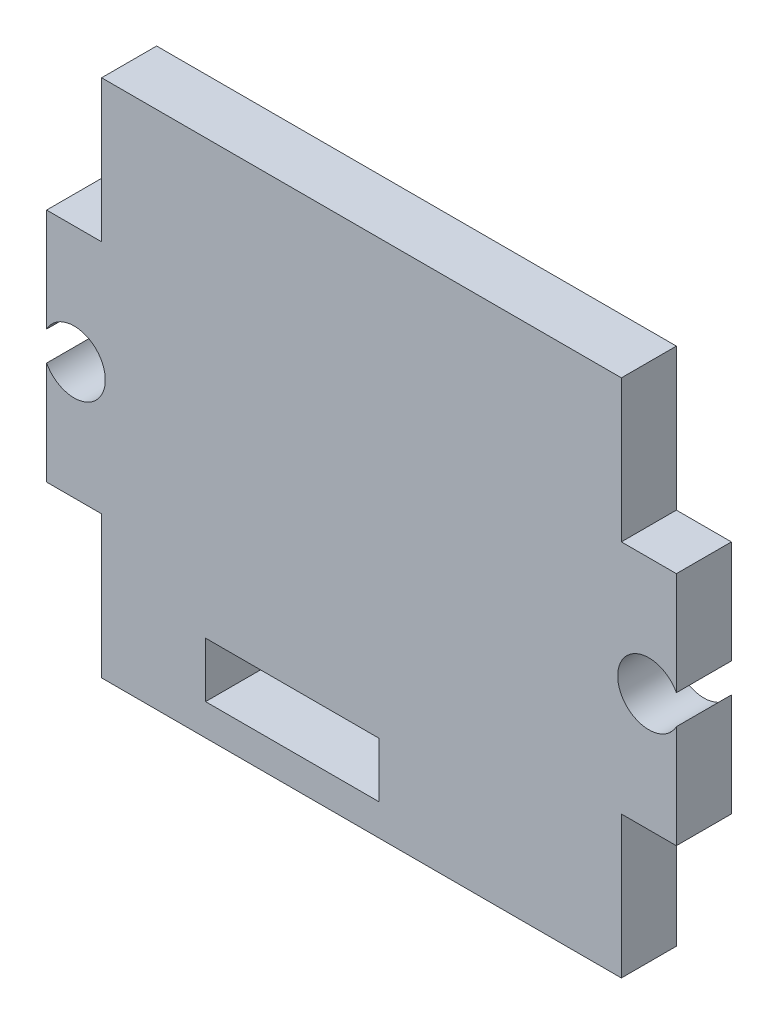
ISO-10303-21;
HEADER;
FILE_DESCRIPTION(('STEP AP214'),'2;1');
FILE_NAME('part.step','',(''),(''),'','','');
FILE_SCHEMA(('AUTOMOTIVE_DESIGN { 1 0 10303 214 1 1 1 1 }'));
ENDSEC;
DATA;
#1=APPLICATION_CONTEXT('core data for automotive mechanical design processes');
#2=APPLICATION_PROTOCOL_DEFINITION('international standard','automotive_design',2000,#1);
#3=PRODUCT_CONTEXT('',#1,'mechanical');
#4=PRODUCT('Part','Part','',(#3));
#5=PRODUCT_RELATED_PRODUCT_CATEGORY('part','',(#4));
#6=PRODUCT_DEFINITION_FORMATION('','',#4);
#7=PRODUCT_DEFINITION_CONTEXT('part definition',#1,'design');
#8=PRODUCT_DEFINITION('design','',#6,#7);
#9=PRODUCT_DEFINITION_SHAPE('','',#8);
#10=(LENGTH_UNIT() NAMED_UNIT(*) SI_UNIT(.MILLI.,.METRE.));
#11=(NAMED_UNIT(*) PLANE_ANGLE_UNIT() SI_UNIT($,.RADIAN.));
#12=(NAMED_UNIT(*) SI_UNIT($,.STERADIAN.) SOLID_ANGLE_UNIT());
#13=UNCERTAINTY_MEASURE_WITH_UNIT(LENGTH_MEASURE(1.E-05),#10,'distance_accuracy_value','');
#14=(GEOMETRIC_REPRESENTATION_CONTEXT(3) GLOBAL_UNCERTAINTY_ASSIGNED_CONTEXT((#13)) GLOBAL_UNIT_ASSIGNED_CONTEXT((#10,
#11,#12)) REPRESENTATION_CONTEXT('',''));
#15=CARTESIAN_POINT('',(0.,0.,0.));
#16=DIRECTION('',(0.,0.,1.));
#17=DIRECTION('',(1.,0.,0.));
#18=AXIS2_PLACEMENT_3D('',#15,#16,#17);
#19=CARTESIAN_POINT('',(-35.2680016104986,32.7807662428356,3.175));
#20=DIRECTION('',(0.,0.,1.));
#21=DIRECTION('',(1.,0.,0.));
#22=AXIS2_PLACEMENT_3D('',#19,#20,#21);
#23=PLANE('',#22);
#24=DIRECTION('',(0.,-1.,0.));
#25=VECTOR('',#24,1.);
#26=CARTESIAN_POINT('',(-33.6805016104986,47.7807662428356,3.175));
#27=LINE('',#26,#25);
#28=CARTESIAN_POINT('',(-33.6805016104986,47.7807662428356,3.175));
#29=VERTEX_POINT('',#28);
#30=CARTESIAN_POINT('',(-33.6805016104986,39.5807662428356,3.175));
#31=VERTEX_POINT('',#30);
#32=EDGE_CURVE('E206',#29,#31,#27,.T.);
#33=ORIENTED_EDGE('',*,*,#32,.T.);
#34=DIRECTION('',(-1.,0.,0.));
#35=VECTOR('',#34,1.);
#36=CARTESIAN_POINT('',(-33.6805016104986,39.5807662428356,3.175));
#37=LINE('',#36,#35);
#38=CARTESIAN_POINT('',(-36.8555016104986,39.5807662428356,3.175));
#39=VERTEX_POINT('',#38);
#40=EDGE_CURVE('E209',#31,#39,#37,.T.);
#41=ORIENTED_EDGE('',*,*,#40,.T.);
#42=DIRECTION('',(0.,-1.,0.));
#43=VECTOR('',#42,1.);
#44=CARTESIAN_POINT('',(-36.8555016104986,39.5807662428356,3.175));
#45=LINE('',#44,#43);
#46=CARTESIAN_POINT('',(-36.8555016104986,33.6292023040683,3.175));
#47=VERTEX_POINT('',#46);
#48=EDGE_CURVE('E212',#39,#47,#45,.T.);
#49=ORIENTED_EDGE('',*,*,#48,.T.);
#50=CARTESIAN_POINT('',(-35.2680016104986,32.7807662428356,3.175));
#51=DIRECTION('',(0.,0.,-1.));
#52=DIRECTION('',(1.,0.,0.));
#53=AXIS2_PLACEMENT_3D('',#50,#51,#52);
#54=CIRCLE('',#53,1.8);
#55=CARTESIAN_POINT('',(-36.8555016104986,31.9323301816029,3.175));
#56=VERTEX_POINT('',#55);
#57=EDGE_CURVE('E214',#47,#56,#54,.T.);
#58=ORIENTED_EDGE('',*,*,#57,.T.);
#59=DIRECTION('',(0.,-1.,0.));
#60=VECTOR('',#59,1.);
#61=CARTESIAN_POINT('',(-36.8555016104986,31.9323301816029,3.175));
#62=LINE('',#61,#60);
#63=CARTESIAN_POINT('',(-36.8555016104986,25.9807662428356,3.175));
#64=VERTEX_POINT('',#63);
#65=EDGE_CURVE('E216',#56,#64,#62,.T.);
#66=ORIENTED_EDGE('',*,*,#65,.T.);
#67=DIRECTION('',(1.,0.,0.));
#68=VECTOR('',#67,1.);
#69=CARTESIAN_POINT('',(-36.8555016104986,25.9807662428356,3.175));
#70=LINE('',#69,#68);
#71=CARTESIAN_POINT('',(-33.6805016104986,25.9807662428356,3.175));
#72=VERTEX_POINT('',#71);
#73=EDGE_CURVE('E218',#64,#72,#70,.T.);
#74=ORIENTED_EDGE('',*,*,#73,.T.);
#75=DIRECTION('',(0.,-1.,0.));
#76=VECTOR('',#75,1.);
#77=CARTESIAN_POINT('',(-33.6805016104986,25.9807662428356,3.175));
#78=LINE('',#77,#76);
#79=CARTESIAN_POINT('',(-33.6805016104986,17.7807662428356,3.175));
#80=VERTEX_POINT('',#79);
#81=EDGE_CURVE('E220',#72,#80,#78,.T.);
#82=ORIENTED_EDGE('',*,*,#81,.T.);
#83=DIRECTION('',(1.,0.,0.));
#84=VECTOR('',#83,1.);
#85=CARTESIAN_POINT('',(-33.6805016104986,17.7807662428356,3.175));
#86=LINE('',#85,#84);
#87=CARTESIAN_POINT('',(-3.68050161049864,17.7807662428356,3.175));
#88=VERTEX_POINT('',#87);
#89=EDGE_CURVE('E222',#80,#88,#86,.T.);
#90=ORIENTED_EDGE('',*,*,#89,.T.);
#91=DIRECTION('',(0.,1.,0.));
#92=VECTOR('',#91,1.);
#93=CARTESIAN_POINT('',(-3.68050161049865,25.9807662428356,3.175));
#94=LINE('',#93,#92);
#95=CARTESIAN_POINT('',(-3.68050161049865,25.9807662428356,3.175));
#96=VERTEX_POINT('',#95);
#97=EDGE_CURVE('E224',#88,#96,#94,.T.);
#98=ORIENTED_EDGE('',*,*,#97,.T.);
#99=DIRECTION('',(1.,0.,0.));
#100=VECTOR('',#99,1.);
#101=CARTESIAN_POINT('',(-0.505501610498657,25.9807662428356,3.175));
#102=LINE('',#101,#100);
#103=CARTESIAN_POINT('',(-0.505501610498657,25.9807662428356,3.175));
#104=VERTEX_POINT('',#103);
#105=EDGE_CURVE('E226',#96,#104,#102,.T.);
#106=ORIENTED_EDGE('',*,*,#105,.T.);
#107=DIRECTION('',(0.,1.,0.));
#108=VECTOR('',#107,1.);
#109=CARTESIAN_POINT('',(-0.505501610498657,31.9323301816029,3.175));
#110=LINE('',#109,#108);
#111=CARTESIAN_POINT('',(-0.50550161049865,31.9323301816029,3.175));
#112=VERTEX_POINT('',#111);
#113=EDGE_CURVE('E228',#104,#112,#110,.T.);
#114=ORIENTED_EDGE('',*,*,#113,.T.);
#115=CARTESIAN_POINT('',(-2.09300161049866,32.7807662428356,3.175));
#116=DIRECTION('',(0.,0.,-1.));
#117=DIRECTION('',(-1.,0.,0.));
#118=AXIS2_PLACEMENT_3D('',#115,#116,#117);
#119=CIRCLE('',#118,1.80000000000001);
#120=CARTESIAN_POINT('',(-0.50550161049865,33.6292023040683,3.175));
#121=VERTEX_POINT('',#120);
#122=EDGE_CURVE('E230',#112,#121,#119,.T.);
#123=ORIENTED_EDGE('',*,*,#122,.T.);
#124=DIRECTION('',(0.,1.,0.));
#125=VECTOR('',#124,1.);
#126=CARTESIAN_POINT('',(-0.50550161049865,39.5807662428356,3.175));
#127=LINE('',#126,#125);
#128=CARTESIAN_POINT('',(-0.50550161049865,39.5807662428356,3.175));
#129=VERTEX_POINT('',#128);
#130=EDGE_CURVE('E232',#121,#129,#127,.T.);
#131=ORIENTED_EDGE('',*,*,#130,.T.);
#132=DIRECTION('',(-1.,0.,0.));
#133=VECTOR('',#132,1.);
#134=CARTESIAN_POINT('',(-3.68050161049865,39.5807662428356,3.175));
#135=LINE('',#134,#133);
#136=CARTESIAN_POINT('',(-3.68050161049865,39.5807662428356,3.175));
#137=VERTEX_POINT('',#136);
#138=EDGE_CURVE('E234',#129,#137,#135,.T.);
#139=ORIENTED_EDGE('',*,*,#138,.T.);
#140=DIRECTION('',(0.,1.,0.));
#141=VECTOR('',#140,1.);
#142=CARTESIAN_POINT('',(-3.68050161049865,47.7807662428356,3.175));
#143=LINE('',#142,#141);
#144=CARTESIAN_POINT('',(-3.68050161049865,47.7807662428356,3.175));
#145=VERTEX_POINT('',#144);
#146=EDGE_CURVE('E236',#137,#145,#143,.T.);
#147=ORIENTED_EDGE('',*,*,#146,.T.);
#148=DIRECTION('',(-1.,0.,0.));
#149=VECTOR('',#148,1.);
#150=CARTESIAN_POINT('',(-33.6805016104986,47.7807662428356,3.175));
#151=LINE('',#150,#149);
#152=EDGE_CURVE('E238',#145,#29,#151,.T.);
#153=ORIENTED_EDGE('',*,*,#152,.T.);
#154=EDGE_LOOP('',(#33,#41,#49,#58,#66,#74,#82,#90,#98,#106,#114,#123,#131,#139,#147,#153));
#155=FACE_BOUND('',#154,.T.);
#156=DIRECTION('',(1.,0.,0.));
#157=VECTOR('',#156,1.);
#158=CARTESIAN_POINT('',(-27.6805016104986,19.5952012369483,3.175));
#159=LINE('',#158,#157);
#160=CARTESIAN_POINT('',(-27.6805016104986,19.5952012369483,3.175));
#161=VERTEX_POINT('',#160);
#162=CARTESIAN_POINT('',(-17.6805016104986,19.5952012369483,3.175));
#163=VERTEX_POINT('',#162);
#164=EDGE_CURVE('E178',#161,#163,#159,.T.);
#165=ORIENTED_EDGE('',*,*,#164,.F.);
#166=DIRECTION('',(0.,-1.,0.));
#167=VECTOR('',#166,1.);
#168=CARTESIAN_POINT('',(-27.6805016104986,22.7702012369483,3.175));
#169=LINE('',#168,#167);
#170=CARTESIAN_POINT('',(-27.6805016104986,22.7702012369483,3.175));
#171=VERTEX_POINT('',#170);
#172=EDGE_CURVE('E170',#171,#161,#169,.T.);
#173=ORIENTED_EDGE('',*,*,#172,.F.);
#174=DIRECTION('',(-1.,0.,0.));
#175=VECTOR('',#174,1.);
#176=CARTESIAN_POINT('',(-27.6805016104986,22.7702012369483,3.175));
#177=LINE('',#176,#175);
#178=CARTESIAN_POINT('',(-17.6805016104986,22.7702012369483,3.175));
#179=VERTEX_POINT('',#178);
#180=EDGE_CURVE('E192',#179,#171,#177,.T.);
#181=ORIENTED_EDGE('',*,*,#180,.F.);
#182=DIRECTION('',(0.,1.,0.));
#183=VECTOR('',#182,1.);
#184=CARTESIAN_POINT('',(-17.6805016104986,22.7702012369483,3.175));
#185=LINE('',#184,#183);
#186=EDGE_CURVE('E190',#163,#179,#185,.T.);
#187=ORIENTED_EDGE('',*,*,#186,.F.);
#188=EDGE_LOOP('',(#165,#173,#181,#187));
#189=FACE_BOUND('',#188,.T.);
#190=ADVANCED_FACE('F33',(#155,#189),#23,.T.);
#191=CARTESIAN_POINT('',(-35.2680016104986,32.7807662428356,0.));
#192=DIRECTION('',(0.,0.,1.));
#193=DIRECTION('',(1.,0.,0.));
#194=AXIS2_PLACEMENT_3D('',#191,#192,#193);
#195=PLANE('',#194);
#196=DIRECTION('',(0.,-1.,0.));
#197=VECTOR('',#196,1.);
#198=CARTESIAN_POINT('',(-33.6805016104986,47.7807662428356,0.));
#199=LINE('',#198,#197);
#200=CARTESIAN_POINT('',(-33.6805016104986,47.7807662428356,0.));
#201=VERTEX_POINT('',#200);
#202=CARTESIAN_POINT('',(-33.6805016104986,39.5807662428356,0.));
#203=VERTEX_POINT('',#202);
#204=EDGE_CURVE('E186',#201,#203,#199,.T.);
#205=ORIENTED_EDGE('',*,*,#204,.F.);
#206=DIRECTION('',(-1.,0.,0.));
#207=VECTOR('',#206,1.);
#208=CARTESIAN_POINT('',(-33.6805016104986,47.7807662428356,0.));
#209=LINE('',#208,#207);
#210=CARTESIAN_POINT('',(-3.68050161049865,47.7807662428356,0.));
#211=VERTEX_POINT('',#210);
#212=EDGE_CURVE('E210',#211,#201,#209,.T.);
#213=ORIENTED_EDGE('',*,*,#212,.F.);
#214=DIRECTION('',(0.,1.,0.));
#215=VECTOR('',#214,1.);
#216=CARTESIAN_POINT('',(-3.68050161049865,47.7807662428356,0.));
#217=LINE('',#216,#215);
#218=CARTESIAN_POINT('',(-3.68050161049865,39.5807662428356,0.));
#219=VERTEX_POINT('',#218);
#220=EDGE_CURVE('E269',#219,#211,#217,.T.);
#221=ORIENTED_EDGE('',*,*,#220,.F.);
#222=DIRECTION('',(-1.,0.,0.));
#223=VECTOR('',#222,1.);
#224=CARTESIAN_POINT('',(-3.68050161049865,39.5807662428356,0.));
#225=LINE('',#224,#223);
#226=CARTESIAN_POINT('',(-0.50550161049865,39.5807662428356,0.));
#227=VERTEX_POINT('',#226);
#228=EDGE_CURVE('E267',#227,#219,#225,.T.);
#229=ORIENTED_EDGE('',*,*,#228,.F.);
#230=DIRECTION('',(0.,1.,0.));
#231=VECTOR('',#230,1.);
#232=CARTESIAN_POINT('',(-0.50550161049865,39.5807662428356,0.));
#233=LINE('',#232,#231);
#234=CARTESIAN_POINT('',(-0.50550161049865,33.6292023040683,0.));
#235=VERTEX_POINT('',#234);
#236=EDGE_CURVE('E265',#235,#227,#233,.T.);
#237=ORIENTED_EDGE('',*,*,#236,.F.);
#238=CARTESIAN_POINT('',(-2.09300161049866,32.7807662428356,0.));
#239=DIRECTION('',(0.,0.,-1.));
#240=DIRECTION('',(-1.,0.,0.));
#241=AXIS2_PLACEMENT_3D('',#238,#239,#240);
#242=CIRCLE('',#241,1.80000000000001);
#243=CARTESIAN_POINT('',(-0.50550161049865,31.9323301816029,0.));
#244=VERTEX_POINT('',#243);
#245=EDGE_CURVE('E263',#244,#235,#242,.T.);
#246=ORIENTED_EDGE('',*,*,#245,.F.);
#247=DIRECTION('',(0.,1.,0.));
#248=VECTOR('',#247,1.);
#249=CARTESIAN_POINT('',(-0.505501610498657,31.9323301816029,0.));
#250=LINE('',#249,#248);
#251=CARTESIAN_POINT('',(-0.505501610498657,25.9807662428356,0.));
#252=VERTEX_POINT('',#251);
#253=EDGE_CURVE('E261',#252,#244,#250,.T.);
#254=ORIENTED_EDGE('',*,*,#253,.F.);
#255=DIRECTION('',(1.,0.,0.));
#256=VECTOR('',#255,1.);
#257=CARTESIAN_POINT('',(-0.505501610498657,25.9807662428356,0.));
#258=LINE('',#257,#256);
#259=CARTESIAN_POINT('',(-3.68050161049865,25.9807662428356,0.));
#260=VERTEX_POINT('',#259);
#261=EDGE_CURVE('E259',#260,#252,#258,.T.);
#262=ORIENTED_EDGE('',*,*,#261,.F.);
#263=DIRECTION('',(0.,1.,0.));
#264=VECTOR('',#263,1.);
#265=CARTESIAN_POINT('',(-3.68050161049865,25.9807662428356,0.));
#266=LINE('',#265,#264);
#267=CARTESIAN_POINT('',(-3.68050161049864,17.7807662428356,0.));
#268=VERTEX_POINT('',#267);
#269=EDGE_CURVE('E257',#268,#260,#266,.T.);
#270=ORIENTED_EDGE('',*,*,#269,.F.);
#271=DIRECTION('',(1.,0.,0.));
#272=VECTOR('',#271,1.);
#273=CARTESIAN_POINT('',(-33.6805016104986,17.7807662428356,0.));
#274=LINE('',#273,#272);
#275=CARTESIAN_POINT('',(-33.6805016104986,17.7807662428356,0.));
#276=VERTEX_POINT('',#275);
#277=EDGE_CURVE('E255',#276,#268,#274,.T.);
#278=ORIENTED_EDGE('',*,*,#277,.F.);
#279=DIRECTION('',(0.,-1.,0.));
#280=VECTOR('',#279,1.);
#281=CARTESIAN_POINT('',(-33.6805016104986,25.9807662428356,0.));
#282=LINE('',#281,#280);
#283=CARTESIAN_POINT('',(-33.6805016104986,25.9807662428356,0.));
#284=VERTEX_POINT('',#283);
#285=EDGE_CURVE('E253',#284,#276,#282,.T.);
#286=ORIENTED_EDGE('',*,*,#285,.F.);
#287=DIRECTION('',(1.,0.,0.));
#288=VECTOR('',#287,1.);
#289=CARTESIAN_POINT('',(-36.8555016104986,25.9807662428356,0.));
#290=LINE('',#289,#288);
#291=CARTESIAN_POINT('',(-36.8555016104986,25.9807662428356,0.));
#292=VERTEX_POINT('',#291);
#293=EDGE_CURVE('E251',#292,#284,#290,.T.);
#294=ORIENTED_EDGE('',*,*,#293,.F.);
#295=DIRECTION('',(0.,-1.,0.));
#296=VECTOR('',#295,1.);
#297=CARTESIAN_POINT('',(-36.8555016104986,31.9323301816029,0.));
#298=LINE('',#297,#296);
#299=CARTESIAN_POINT('',(-36.8555016104986,31.9323301816029,0.));
#300=VERTEX_POINT('',#299);
#301=EDGE_CURVE('E249',#300,#292,#298,.T.);
#302=ORIENTED_EDGE('',*,*,#301,.F.);
#303=CARTESIAN_POINT('',(-35.2680016104986,32.7807662428356,0.));
#304=DIRECTION('',(0.,0.,-1.));
#305=DIRECTION('',(1.,0.,0.));
#306=AXIS2_PLACEMENT_3D('',#303,#304,#305);
#307=CIRCLE('',#306,1.8);
#308=CARTESIAN_POINT('',(-36.8555016104986,33.6292023040683,0.));
#309=VERTEX_POINT('',#308);
#310=EDGE_CURVE('E247',#309,#300,#307,.T.);
#311=ORIENTED_EDGE('',*,*,#310,.F.);
#312=DIRECTION('',(0.,-1.,0.));
#313=VECTOR('',#312,1.);
#314=CARTESIAN_POINT('',(-36.8555016104986,39.5807662428356,0.));
#315=LINE('',#314,#313);
#316=CARTESIAN_POINT('',(-36.8555016104986,39.5807662428356,0.));
#317=VERTEX_POINT('',#316);
#318=EDGE_CURVE('E245',#317,#309,#315,.T.);
#319=ORIENTED_EDGE('',*,*,#318,.F.);
#320=DIRECTION('',(-1.,0.,0.));
#321=VECTOR('',#320,1.);
#322=CARTESIAN_POINT('',(-33.6805016104986,39.5807662428356,0.));
#323=LINE('',#322,#321);
#324=EDGE_CURVE('E243',#203,#317,#323,.T.);
#325=ORIENTED_EDGE('',*,*,#324,.F.);
#326=EDGE_LOOP('',(#205,#213,#221,#229,#237,#246,#254,#262,#270,#278,#286,#294,#302,#311,#319,#325));
#327=FACE_BOUND('',#326,.T.);
#328=DIRECTION('',(0.,-1.,0.));
#329=VECTOR('',#328,1.);
#330=CARTESIAN_POINT('',(-27.6805016104986,22.7702012369483,0.));
#331=LINE('',#330,#329);
#332=CARTESIAN_POINT('',(-27.6805016104986,22.7702012369483,0.));
#333=VERTEX_POINT('',#332);
#334=CARTESIAN_POINT('',(-27.6805016104986,19.5952012369483,0.));
#335=VERTEX_POINT('',#334);
#336=EDGE_CURVE('E56',#333,#335,#331,.T.);
#337=ORIENTED_EDGE('',*,*,#336,.T.);
#338=DIRECTION('',(1.,0.,0.));
#339=VECTOR('',#338,1.);
#340=CARTESIAN_POINT('',(-27.6805016104986,19.5952012369483,0.));
#341=LINE('',#340,#339);
#342=CARTESIAN_POINT('',(-17.6805016104986,19.5952012369483,0.));
#343=VERTEX_POINT('',#342);
#344=EDGE_CURVE('E185',#335,#343,#341,.T.);
#345=ORIENTED_EDGE('',*,*,#344,.T.);
#346=DIRECTION('',(0.,1.,0.));
#347=VECTOR('',#346,1.);
#348=CARTESIAN_POINT('',(-17.6805016104986,22.7702012369483,0.));
#349=LINE('',#348,#347);
#350=CARTESIAN_POINT('',(-17.6805016104986,22.7702012369483,0.));
#351=VERTEX_POINT('',#350);
#352=EDGE_CURVE('E198',#343,#351,#349,.T.);
#353=ORIENTED_EDGE('',*,*,#352,.T.);
#354=DIRECTION('',(-1.,0.,0.));
#355=VECTOR('',#354,1.);
#356=CARTESIAN_POINT('',(-27.6805016104986,22.7702012369483,0.));
#357=LINE('',#356,#355);
#358=EDGE_CURVE('E179',#351,#333,#357,.T.);
#359=ORIENTED_EDGE('',*,*,#358,.T.);
#360=EDGE_LOOP('',(#337,#345,#353,#359));
#361=FACE_BOUND('',#360,.T.);
#362=ADVANCED_FACE('F323',(#327,#361),#195,.F.);
#363=CARTESIAN_POINT('',(-33.6805016104986,47.7807662428356,3.175));
#364=DIRECTION('',(1.,0.,0.));
#365=DIRECTION('',(0.,0.,-1.));
#366=AXIS2_PLACEMENT_3D('',#363,#364,#365);
#367=PLANE('',#366);
#368=ORIENTED_EDGE('',*,*,#204,.T.);
#369=DIRECTION('',(0.,0.,-1.));
#370=VECTOR('',#369,1.);
#371=CARTESIAN_POINT('',(-33.6805016104986,39.5807662428356,3.175));
#372=LINE('',#371,#370);
#373=EDGE_CURVE('E11',#31,#203,#372,.T.);
#374=ORIENTED_EDGE('',*,*,#373,.F.);
#375=ORIENTED_EDGE('',*,*,#32,.F.);
#376=DIRECTION('',(0.,0.,-1.));
#377=VECTOR('',#376,1.);
#378=CARTESIAN_POINT('',(-33.6805016104986,47.7807662428356,3.175));
#379=LINE('',#378,#377);
#380=EDGE_CURVE('E240',#29,#201,#379,.T.);
#381=ORIENTED_EDGE('',*,*,#380,.T.);
#382=EDGE_LOOP('',(#368,#374,#375,#381));
#383=FACE_BOUND('',#382,.T.);
#384=ADVANCED_FACE('F35',(#383),#367,.F.);
#385=CARTESIAN_POINT('',(-33.6805016104986,39.5807662428356,3.175));
#386=DIRECTION('',(0.,-1.,0.));
#387=DIRECTION('',(0.,0.,-1.));
#388=AXIS2_PLACEMENT_3D('',#385,#386,#387);
#389=PLANE('',#388);
#390=ORIENTED_EDGE('',*,*,#324,.T.);
#391=DIRECTION('',(0.,0.,-1.));
#392=VECTOR('',#391,1.);
#393=CARTESIAN_POINT('',(-36.8555016104986,39.5807662428356,3.175));
#394=LINE('',#393,#392);
#395=EDGE_CURVE('E41',#39,#317,#394,.T.);
#396=ORIENTED_EDGE('',*,*,#395,.F.);
#397=ORIENTED_EDGE('',*,*,#40,.F.);
#398=ORIENTED_EDGE('',*,*,#373,.T.);
#399=EDGE_LOOP('',(#390,#396,#397,#398));
#400=FACE_BOUND('',#399,.T.);
#401=ADVANCED_FACE('F340',(#400),#389,.F.);
#402=CARTESIAN_POINT('',(-36.8555016104986,39.5807662428356,3.175));
#403=DIRECTION('',(1.,0.,0.));
#404=DIRECTION('',(0.,1.,0.));
#405=AXIS2_PLACEMENT_3D('',#402,#403,#404);
#406=PLANE('',#405);
#407=ORIENTED_EDGE('',*,*,#318,.T.);
#408=DIRECTION('',(0.,0.,-1.));
#409=VECTOR('',#408,1.);
#410=CARTESIAN_POINT('',(-36.8555016104986,33.6292023040683,3.175));
#411=LINE('',#410,#409);
#412=EDGE_CURVE('E310',#47,#309,#411,.T.);
#413=ORIENTED_EDGE('',*,*,#412,.F.);
#414=ORIENTED_EDGE('',*,*,#48,.F.);
#415=ORIENTED_EDGE('',*,*,#395,.T.);
#416=EDGE_LOOP('',(#407,#413,#414,#415));
#417=FACE_BOUND('',#416,.T.);
#418=ADVANCED_FACE('F317',(#417),#406,.F.);
#419=CARTESIAN_POINT('',(-35.2680016104986,32.7807662428356,3.175));
#420=DIRECTION('',(0.,0.,-1.));
#421=DIRECTION('',(-1.,0.,0.));
#422=AXIS2_PLACEMENT_3D('',#419,#420,#421);
#423=CYLINDRICAL_SURFACE('',#422,1.8);
#424=ORIENTED_EDGE('',*,*,#310,.T.);
#425=DIRECTION('',(0.,0.,-1.));
#426=VECTOR('',#425,1.);
#427=CARTESIAN_POINT('',(-36.8555016104986,31.9323301816029,3.175));
#428=LINE('',#427,#426);
#429=EDGE_CURVE('E307',#56,#300,#428,.T.);
#430=ORIENTED_EDGE('',*,*,#429,.F.);
#431=ORIENTED_EDGE('',*,*,#57,.F.);
#432=ORIENTED_EDGE('',*,*,#412,.T.);
#433=EDGE_LOOP('',(#424,#430,#431,#432));
#434=FACE_BOUND('',#433,.T.);
#435=ADVANCED_FACE('F329',(#434),#423,.F.);
#436=CARTESIAN_POINT('',(-36.8555016104986,31.9323301816029,3.175));
#437=DIRECTION('',(1.,0.,0.));
#438=DIRECTION('',(0.,0.,-1.));
#439=AXIS2_PLACEMENT_3D('',#436,#437,#438);
#440=PLANE('',#439);
#441=ORIENTED_EDGE('',*,*,#301,.T.);
#442=DIRECTION('',(0.,0.,-1.));
#443=VECTOR('',#442,1.);
#444=CARTESIAN_POINT('',(-36.8555016104986,25.9807662428356,3.175));
#445=LINE('',#444,#443);
#446=EDGE_CURVE('E304',#64,#292,#445,.T.);
#447=ORIENTED_EDGE('',*,*,#446,.F.);
#448=ORIENTED_EDGE('',*,*,#65,.F.);
#449=ORIENTED_EDGE('',*,*,#429,.T.);
#450=EDGE_LOOP('',(#441,#447,#448,#449));
#451=FACE_BOUND('',#450,.T.);
#452=ADVANCED_FACE('F333',(#451),#440,.F.);
#453=CARTESIAN_POINT('',(-36.8555016104986,25.9807662428356,3.175));
#454=DIRECTION('',(0.,1.,0.));
#455=DIRECTION('',(-1.,0.,0.));
#456=AXIS2_PLACEMENT_3D('',#453,#454,#455);
#457=PLANE('',#456);
#458=ORIENTED_EDGE('',*,*,#293,.T.);
#459=DIRECTION('',(0.,0.,-1.));
#460=VECTOR('',#459,1.);
#461=CARTESIAN_POINT('',(-33.6805016104986,25.9807662428356,3.175));
#462=LINE('',#461,#460);
#463=EDGE_CURVE('E301',#72,#284,#462,.T.);
#464=ORIENTED_EDGE('',*,*,#463,.F.);
#465=ORIENTED_EDGE('',*,*,#73,.F.);
#466=ORIENTED_EDGE('',*,*,#446,.T.);
#467=EDGE_LOOP('',(#458,#464,#465,#466));
#468=FACE_BOUND('',#467,.T.);
#469=ADVANCED_FACE('F393',(#468),#457,.F.);
#470=CARTESIAN_POINT('',(-33.6805016104986,25.9807662428356,3.175));
#471=DIRECTION('',(1.,0.,0.));
#472=DIRECTION('',(0.,0.,-1.));
#473=AXIS2_PLACEMENT_3D('',#470,#471,#472);
#474=PLANE('',#473);
#475=ORIENTED_EDGE('',*,*,#285,.T.);
#476=DIRECTION('',(0.,0.,-1.));
#477=VECTOR('',#476,1.);
#478=CARTESIAN_POINT('',(-33.6805016104986,17.7807662428356,3.175));
#479=LINE('',#478,#477);
#480=EDGE_CURVE('E298',#80,#276,#479,.T.);
#481=ORIENTED_EDGE('',*,*,#480,.F.);
#482=ORIENTED_EDGE('',*,*,#81,.F.);
#483=ORIENTED_EDGE('',*,*,#463,.T.);
#484=EDGE_LOOP('',(#475,#481,#482,#483));
#485=FACE_BOUND('',#484,.T.);
#486=ADVANCED_FACE('F390',(#485),#474,.F.);
#487=CARTESIAN_POINT('',(-33.6805016104986,17.7807662428356,3.175));
#488=DIRECTION('',(0.,1.,0.));
#489=DIRECTION('',(0.,0.,1.));
#490=AXIS2_PLACEMENT_3D('',#487,#488,#489);
#491=PLANE('',#490);
#492=ORIENTED_EDGE('',*,*,#277,.T.);
#493=DIRECTION('',(0.,0.,-1.));
#494=VECTOR('',#493,1.);
#495=CARTESIAN_POINT('',(-3.68050161049864,17.7807662428356,3.175));
#496=LINE('',#495,#494);
#497=EDGE_CURVE('E295',#88,#268,#496,.T.);
#498=ORIENTED_EDGE('',*,*,#497,.F.);
#499=ORIENTED_EDGE('',*,*,#89,.F.);
#500=ORIENTED_EDGE('',*,*,#480,.T.);
#501=EDGE_LOOP('',(#492,#498,#499,#500));
#502=FACE_BOUND('',#501,.T.);
#503=ADVANCED_FACE('F386',(#502),#491,.F.);
#504=CARTESIAN_POINT('',(-3.68050161049865,25.9807662428356,3.175));
#505=DIRECTION('',(-1.,0.,0.));
#506=DIRECTION('',(0.,-1.,0.));
#507=AXIS2_PLACEMENT_3D('',#504,#505,#506);
#508=PLANE('',#507);
#509=ORIENTED_EDGE('',*,*,#269,.T.);
#510=DIRECTION('',(0.,0.,-1.));
#511=VECTOR('',#510,1.);
#512=CARTESIAN_POINT('',(-3.68050161049865,25.9807662428356,3.175));
#513=LINE('',#512,#511);
#514=EDGE_CURVE('E292',#96,#260,#513,.T.);
#515=ORIENTED_EDGE('',*,*,#514,.F.);
#516=ORIENTED_EDGE('',*,*,#97,.F.);
#517=ORIENTED_EDGE('',*,*,#497,.T.);
#518=EDGE_LOOP('',(#509,#515,#516,#517));
#519=FACE_BOUND('',#518,.T.);
#520=ADVANCED_FACE('F382',(#519),#508,.F.);
#521=CARTESIAN_POINT('',(-0.505501610498657,25.9807662428356,3.175));
#522=DIRECTION('',(0.,1.,0.));
#523=DIRECTION('',(-1.,0.,0.));
#524=AXIS2_PLACEMENT_3D('',#521,#522,#523);
#525=PLANE('',#524);
#526=ORIENTED_EDGE('',*,*,#261,.T.);
#527=DIRECTION('',(0.,0.,-1.));
#528=VECTOR('',#527,1.);
#529=CARTESIAN_POINT('',(-0.505501610498657,25.9807662428356,3.175));
#530=LINE('',#529,#528);
#531=EDGE_CURVE('E289',#104,#252,#530,.T.);
#532=ORIENTED_EDGE('',*,*,#531,.F.);
#533=ORIENTED_EDGE('',*,*,#105,.F.);
#534=ORIENTED_EDGE('',*,*,#514,.T.);
#535=EDGE_LOOP('',(#526,#532,#533,#534));
#536=FACE_BOUND('',#535,.T.);
#537=ADVANCED_FACE('F377',(#536),#525,.F.);
#538=CARTESIAN_POINT('',(-0.505501610498657,31.9323301816029,3.175));
#539=DIRECTION('',(-1.,0.,0.));
#540=DIRECTION('',(0.,0.,1.));
#541=AXIS2_PLACEMENT_3D('',#538,#539,#540);
#542=PLANE('',#541);
#543=ORIENTED_EDGE('',*,*,#253,.T.);
#544=DIRECTION('',(0.,0.,-1.));
#545=VECTOR('',#544,1.);
#546=CARTESIAN_POINT('',(-0.50550161049865,31.9323301816029,3.175));
#547=LINE('',#546,#545);
#548=EDGE_CURVE('E286',#112,#244,#547,.T.);
#549=ORIENTED_EDGE('',*,*,#548,.F.);
#550=ORIENTED_EDGE('',*,*,#113,.F.);
#551=ORIENTED_EDGE('',*,*,#531,.T.);
#552=EDGE_LOOP('',(#543,#549,#550,#551));
#553=FACE_BOUND('',#552,.T.);
#554=ADVANCED_FACE('F371',(#553),#542,.F.);
#555=CARTESIAN_POINT('',(-2.09300161049866,32.7807662428356,3.175));
#556=DIRECTION('',(0.,0.,-1.));
#557=DIRECTION('',(-1.,0.,0.));
#558=AXIS2_PLACEMENT_3D('',#555,#556,#557);
#559=CYLINDRICAL_SURFACE('',#558,1.80000000000001);
#560=ORIENTED_EDGE('',*,*,#245,.T.);
#561=DIRECTION('',(0.,0.,-1.));
#562=VECTOR('',#561,1.);
#563=CARTESIAN_POINT('',(-0.50550161049865,33.6292023040683,3.175));
#564=LINE('',#563,#562);
#565=EDGE_CURVE('E283',#121,#235,#564,.T.);
#566=ORIENTED_EDGE('',*,*,#565,.F.);
#567=ORIENTED_EDGE('',*,*,#122,.F.);
#568=ORIENTED_EDGE('',*,*,#548,.T.);
#569=EDGE_LOOP('',(#560,#566,#567,#568));
#570=FACE_BOUND('',#569,.T.);
#571=ADVANCED_FACE('F367',(#570),#559,.F.);
#572=CARTESIAN_POINT('',(-0.50550161049865,39.5807662428356,3.175));
#573=DIRECTION('',(-1.,0.,0.));
#574=DIRECTION('',(0.,0.,1.));
#575=AXIS2_PLACEMENT_3D('',#572,#573,#574);
#576=PLANE('',#575);
#577=ORIENTED_EDGE('',*,*,#236,.T.);
#578=DIRECTION('',(0.,0.,-1.));
#579=VECTOR('',#578,1.);
#580=CARTESIAN_POINT('',(-0.50550161049865,39.5807662428356,3.175));
#581=LINE('',#580,#579);
#582=EDGE_CURVE('E280',#129,#227,#581,.T.);
#583=ORIENTED_EDGE('',*,*,#582,.F.);
#584=ORIENTED_EDGE('',*,*,#130,.F.);
#585=ORIENTED_EDGE('',*,*,#565,.T.);
#586=EDGE_LOOP('',(#577,#583,#584,#585));
#587=FACE_BOUND('',#586,.T.);
#588=ADVANCED_FACE('F362',(#587),#576,.F.);
#589=CARTESIAN_POINT('',(-3.68050161049865,39.5807662428356,3.175));
#590=DIRECTION('',(0.,-1.,0.));
#591=DIRECTION('',(0.,0.,-1.));
#592=AXIS2_PLACEMENT_3D('',#589,#590,#591);
#593=PLANE('',#592);
#594=ORIENTED_EDGE('',*,*,#228,.T.);
#595=DIRECTION('',(0.,0.,-1.));
#596=VECTOR('',#595,1.);
#597=CARTESIAN_POINT('',(-3.68050161049865,39.5807662428356,3.175));
#598=LINE('',#597,#596);
#599=EDGE_CURVE('E277',#137,#219,#598,.T.);
#600=ORIENTED_EDGE('',*,*,#599,.F.);
#601=ORIENTED_EDGE('',*,*,#138,.F.);
#602=ORIENTED_EDGE('',*,*,#582,.T.);
#603=EDGE_LOOP('',(#594,#600,#601,#602));
#604=FACE_BOUND('',#603,.T.);
#605=ADVANCED_FACE('F356',(#604),#593,.F.);
#606=CARTESIAN_POINT('',(-3.68050161049865,47.7807662428356,3.175));
#607=DIRECTION('',(-1.,0.,0.));
#608=DIRECTION('',(0.,-1.,0.));
#609=AXIS2_PLACEMENT_3D('',#606,#607,#608);
#610=PLANE('',#609);
#611=ORIENTED_EDGE('',*,*,#220,.T.);
#612=DIRECTION('',(0.,0.,-1.));
#613=VECTOR('',#612,1.);
#614=CARTESIAN_POINT('',(-3.68050161049865,47.7807662428356,3.175));
#615=LINE('',#614,#613);
#616=EDGE_CURVE('E274',#145,#211,#615,.T.);
#617=ORIENTED_EDGE('',*,*,#616,.F.);
#618=ORIENTED_EDGE('',*,*,#146,.F.);
#619=ORIENTED_EDGE('',*,*,#599,.T.);
#620=EDGE_LOOP('',(#611,#617,#618,#619));
#621=FACE_BOUND('',#620,.T.);
#622=ADVANCED_FACE('F352',(#621),#610,.F.);
#623=CARTESIAN_POINT('',(-33.6805016104986,47.7807662428356,3.175));
#624=DIRECTION('',(0.,-1.,0.));
#625=DIRECTION('',(0.,0.,-1.));
#626=AXIS2_PLACEMENT_3D('',#623,#624,#625);
#627=PLANE('',#626);
#628=ORIENTED_EDGE('',*,*,#212,.T.);
#629=ORIENTED_EDGE('',*,*,#380,.F.);
#630=ORIENTED_EDGE('',*,*,#152,.F.);
#631=ORIENTED_EDGE('',*,*,#616,.T.);
#632=EDGE_LOOP('',(#628,#629,#630,#631));
#633=FACE_BOUND('',#632,.T.);
#634=ADVANCED_FACE('F347',(#633),#627,.F.);
#635=CARTESIAN_POINT('',(-27.6805016104986,22.7702012369483,3.175));
#636=DIRECTION('',(1.,0.,0.));
#637=DIRECTION('',(0.,0.,-1.));
#638=AXIS2_PLACEMENT_3D('',#635,#636,#637);
#639=PLANE('',#638);
#640=ORIENTED_EDGE('',*,*,#336,.F.);
#641=DIRECTION('',(0.,0.,-1.));
#642=VECTOR('',#641,1.);
#643=CARTESIAN_POINT('',(-27.6805016104986,22.7702012369483,3.175));
#644=LINE('',#643,#642);
#645=EDGE_CURVE('E174',#171,#333,#644,.T.);
#646=ORIENTED_EDGE('',*,*,#645,.F.);
#647=ORIENTED_EDGE('',*,*,#172,.T.);
#648=DIRECTION('',(0.,0.,-1.));
#649=VECTOR('',#648,1.);
#650=CARTESIAN_POINT('',(-27.6805016104986,19.5952012369483,3.175));
#651=LINE('',#650,#649);
#652=EDGE_CURVE('E173',#161,#335,#651,.T.);
#653=ORIENTED_EDGE('',*,*,#652,.T.);
#654=EDGE_LOOP('',(#640,#646,#647,#653));
#655=FACE_BOUND('',#654,.T.);
#656=ADVANCED_FACE('F172',(#655),#639,.T.);
#657=CARTESIAN_POINT('',(-27.6805016104986,19.5952012369483,3.175));
#658=DIRECTION('',(0.,1.,0.));
#659=DIRECTION('',(0.,0.,1.));
#660=AXIS2_PLACEMENT_3D('',#657,#658,#659);
#661=PLANE('',#660);
#662=ORIENTED_EDGE('',*,*,#344,.F.);
#663=ORIENTED_EDGE('',*,*,#652,.F.);
#664=ORIENTED_EDGE('',*,*,#164,.T.);
#665=DIRECTION('',(0.,0.,-1.));
#666=VECTOR('',#665,1.);
#667=CARTESIAN_POINT('',(-17.6805016104986,19.5952012369483,3.175));
#668=LINE('',#667,#666);
#669=EDGE_CURVE('E187',#163,#343,#668,.T.);
#670=ORIENTED_EDGE('',*,*,#669,.T.);
#671=EDGE_LOOP('',(#662,#663,#664,#670));
#672=FACE_BOUND('',#671,.T.);
#673=ADVANCED_FACE('F182',(#672),#661,.T.);
#674=CARTESIAN_POINT('',(-17.6805016104986,22.7702012369483,3.175));
#675=DIRECTION('',(-1.,0.,0.));
#676=DIRECTION('',(0.,0.,1.));
#677=AXIS2_PLACEMENT_3D('',#674,#675,#676);
#678=PLANE('',#677);
#679=ORIENTED_EDGE('',*,*,#352,.F.);
#680=ORIENTED_EDGE('',*,*,#669,.F.);
#681=ORIENTED_EDGE('',*,*,#186,.T.);
#682=DIRECTION('',(0.,0.,-1.));
#683=VECTOR('',#682,1.);
#684=CARTESIAN_POINT('',(-17.6805016104986,22.7702012369483,3.175));
#685=LINE('',#684,#683);
#686=EDGE_CURVE('E48',#179,#351,#685,.T.);
#687=ORIENTED_EDGE('',*,*,#686,.T.);
#688=EDGE_LOOP('',(#679,#680,#681,#687));
#689=FACE_BOUND('',#688,.T.);
#690=ADVANCED_FACE('F475',(#689),#678,.T.);
#691=CARTESIAN_POINT('',(-27.6805016104986,22.7702012369483,3.175));
#692=DIRECTION('',(0.,-1.,0.));
#693=DIRECTION('',(0.,0.,-1.));
#694=AXIS2_PLACEMENT_3D('',#691,#692,#693);
#695=PLANE('',#694);
#696=ORIENTED_EDGE('',*,*,#358,.F.);
#697=ORIENTED_EDGE('',*,*,#686,.F.);
#698=ORIENTED_EDGE('',*,*,#180,.T.);
#699=ORIENTED_EDGE('',*,*,#645,.T.);
#700=EDGE_LOOP('',(#696,#697,#698,#699));
#701=FACE_BOUND('',#700,.T.);
#702=ADVANCED_FACE('F481',(#701),#695,.T.);
#703=CLOSED_SHELL('',(#190,#362,#384,#401,#418,#435,#452,#469,#486,#503,#520,#537,#554,#571,
#588,#605,#622,#634,#656,#673,#690,#702));
#704=MANIFOLD_SOLID_BREP('B2',#703);
#705=ADVANCED_BREP_SHAPE_REPRESENTATION('',(#18,#704),#14);
#706=SHAPE_DEFINITION_REPRESENTATION(#9,#705);
ENDSEC;
END-ISO-10303-21;
